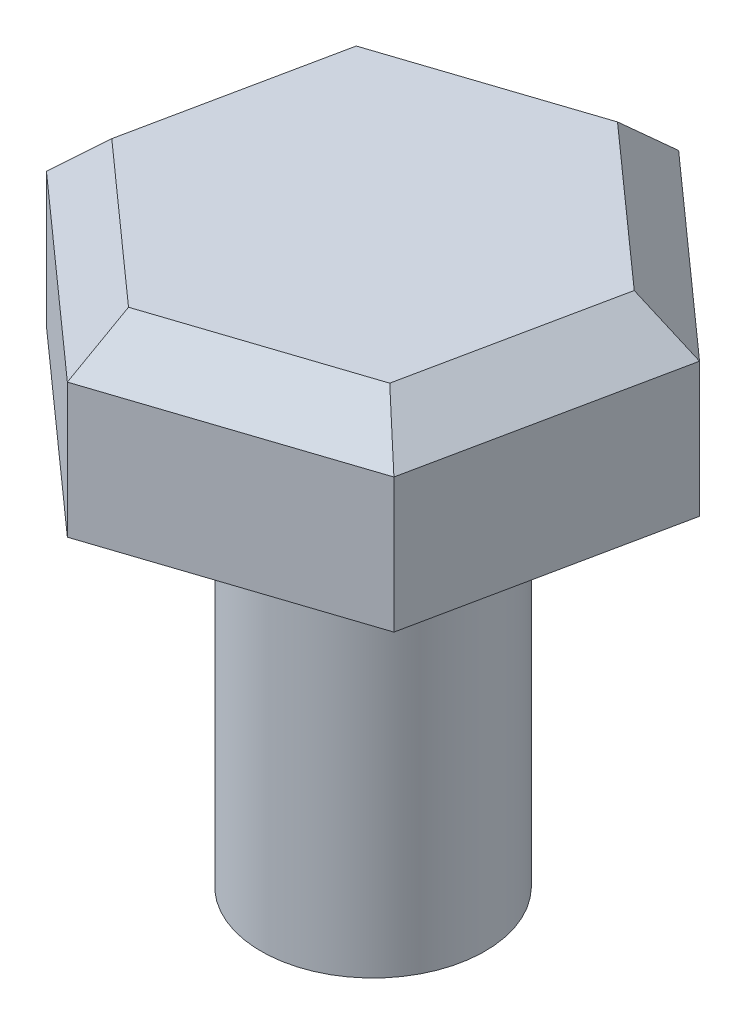
ISO-10303-21;
HEADER;
FILE_DESCRIPTION(('STEP AP214'),'2;1');
FILE_NAME('part.step','',(''),(''),'','','');
FILE_SCHEMA(('AUTOMOTIVE_DESIGN { 1 0 10303 214 1 1 1 1 }'));
ENDSEC;
DATA;
#1=APPLICATION_CONTEXT('core data for automotive mechanical design processes');
#2=APPLICATION_PROTOCOL_DEFINITION('international standard','automotive_design',2000,#1);
#3=PRODUCT_CONTEXT('',#1,'mechanical');
#4=PRODUCT('Part','Part','',(#3));
#5=PRODUCT_RELATED_PRODUCT_CATEGORY('part','',(#4));
#6=PRODUCT_DEFINITION_FORMATION('','',#4);
#7=PRODUCT_DEFINITION_CONTEXT('part definition',#1,'design');
#8=PRODUCT_DEFINITION('design','',#6,#7);
#9=PRODUCT_DEFINITION_SHAPE('','',#8);
#10=(LENGTH_UNIT() NAMED_UNIT(*) SI_UNIT(.MILLI.,.METRE.));
#11=(NAMED_UNIT(*) PLANE_ANGLE_UNIT() SI_UNIT($,.RADIAN.));
#12=(NAMED_UNIT(*) SI_UNIT($,.STERADIAN.) SOLID_ANGLE_UNIT());
#13=UNCERTAINTY_MEASURE_WITH_UNIT(LENGTH_MEASURE(1.E-05),#10,'distance_accuracy_value','');
#14=(GEOMETRIC_REPRESENTATION_CONTEXT(3) GLOBAL_UNCERTAINTY_ASSIGNED_CONTEXT((#13)) GLOBAL_UNIT_ASSIGNED_CONTEXT((#10,
#11,#12)) REPRESENTATION_CONTEXT('',''));
#15=CARTESIAN_POINT('',(0.,0.,0.));
#16=DIRECTION('',(0.,0.,1.));
#17=DIRECTION('',(1.,0.,0.));
#18=AXIS2_PLACEMENT_3D('',#15,#16,#17);
#19=CARTESIAN_POINT('',(4.3092791139155,4.,3.84232310610456));
#20=DIRECTION('',(-0.979146809030773,0.,-0.203153947450832));
#21=DIRECTION('',(-0.203153947450832,0.,0.979146809030773));
#22=AXIS2_PLACEMENT_3D('',#19,#20,#21);
#23=PLANE('',#22);
#24=DIRECTION('',(0.,-1.,0.));
#25=VECTOR('',#24,1.);
#26=CARTESIAN_POINT('',(5.48218897639223,4.,-1.81078363159624));
#27=LINE('',#26,#25);
#28=CARTESIAN_POINT('',(5.48218897639223,3.,-1.81078363159624));
#29=VERTEX_POINT('',#28);
#30=CARTESIAN_POINT('',(5.48218897639223,0.,-1.81078363159624));
#31=VERTEX_POINT('',#30);
#32=EDGE_CURVE('E119',#29,#31,#27,.T.);
#33=ORIENTED_EDGE('',*,*,#32,.F.);
#34=DIRECTION('',(-0.203153947450832,0.,0.979146809030773));
#35=VECTOR('',#34,1.);
#36=CARTESIAN_POINT('',(4.3092791139155,3.,3.84232310610456));
#37=LINE('',#36,#35);
#38=CARTESIAN_POINT('',(4.3092791139155,3.,3.84232310610456));
#39=VERTEX_POINT('',#38);
#40=EDGE_CURVE('E56',#29,#39,#37,.T.);
#41=ORIENTED_EDGE('',*,*,#40,.T.);
#42=DIRECTION('',(0.,-1.,0.));
#43=VECTOR('',#42,1.);
#44=CARTESIAN_POINT('',(4.3092791139155,4.,3.84232310610456));
#45=LINE('',#44,#43);
#46=CARTESIAN_POINT('',(4.3092791139155,0.,3.84232310610456));
#47=VERTEX_POINT('',#46);
#48=EDGE_CURVE('E142',#39,#47,#45,.T.);
#49=ORIENTED_EDGE('',*,*,#48,.T.);
#50=DIRECTION('',(0.203153947450832,0.,-0.979146809030773));
#51=VECTOR('',#50,1.);
#52=CARTESIAN_POINT('',(4.3092791139155,0.,3.84232310610456));
#53=LINE('',#52,#51);
#54=EDGE_CURVE('E135',#47,#31,#53,.T.);
#55=ORIENTED_EDGE('',*,*,#54,.T.);
#56=EDGE_LOOP('',(#33,#41,#49,#55));
#57=FACE_BOUND('',#56,.T.);
#58=ADVANCED_FACE('F45',(#57),#23,.F.);
#59=CARTESIAN_POINT('',(5.48218897639223,4.,-1.81078363159624));
#60=DIRECTION('',(-0.665509883886896,0.,0.746389036929703));
#61=DIRECTION('',(0.746389036929703,0.,0.665509883886896));
#62=AXIS2_PLACEMENT_3D('',#59,#60,#61);
#63=PLANE('',#62);
#64=DIRECTION('',(0.,-1.,0.));
#65=VECTOR('',#64,1.);
#66=CARTESIAN_POINT('',(1.17290986247673,4.,-5.6531067377008));
#67=LINE('',#66,#65);
#68=CARTESIAN_POINT('',(1.17290986247673,3.,-5.6531067377008));
#69=VERTEX_POINT('',#68);
#70=CARTESIAN_POINT('',(1.17290986247673,0.,-5.6531067377008));
#71=VERTEX_POINT('',#70);
#72=EDGE_CURVE('E129',#69,#71,#67,.T.);
#73=ORIENTED_EDGE('',*,*,#72,.F.);
#74=DIRECTION('',(0.746389036929703,0.,0.665509883886896));
#75=VECTOR('',#74,1.);
#76=CARTESIAN_POINT('',(5.48218897639223,3.,-1.81078363159624));
#77=LINE('',#76,#75);
#78=EDGE_CURVE('E64',#69,#29,#77,.T.);
#79=ORIENTED_EDGE('',*,*,#78,.T.);
#80=ORIENTED_EDGE('',*,*,#32,.T.);
#81=DIRECTION('',(-0.746389036929704,0.,-0.665509883886896));
#82=VECTOR('',#81,1.);
#83=CARTESIAN_POINT('',(5.48218897639223,0.,-1.81078363159624));
#84=LINE('',#83,#82);
#85=EDGE_CURVE('E122',#31,#71,#84,.T.);
#86=ORIENTED_EDGE('',*,*,#85,.T.);
#87=EDGE_LOOP('',(#73,#79,#80,#86));
#88=FACE_BOUND('',#87,.T.);
#89=ADVANCED_FACE('F121',(#88),#63,.F.);
#90=CARTESIAN_POINT('',(1.17290986247673,4.,-5.6531067377008));
#91=DIRECTION('',(0.313636925143877,0.,0.949542984380536));
#92=DIRECTION('',(0.949542984380536,0.,-0.313636925143877));
#93=AXIS2_PLACEMENT_3D('',#90,#91,#92);
#94=PLANE('',#93);
#95=DIRECTION('',(0.,-1.,0.));
#96=VECTOR('',#95,1.);
#97=CARTESIAN_POINT('',(-4.3092791139155,4.,-3.84232310610456));
#98=LINE('',#97,#96);
#99=CARTESIAN_POINT('',(-4.3092791139155,3.,-3.84232310610456));
#100=VERTEX_POINT('',#99);
#101=CARTESIAN_POINT('',(-4.3092791139155,0.,-3.84232310610456));
#102=VERTEX_POINT('',#101);
#103=EDGE_CURVE('E172',#100,#102,#98,.T.);
#104=ORIENTED_EDGE('',*,*,#103,.F.);
#105=DIRECTION('',(0.949542984380536,0.,-0.313636925143877));
#106=VECTOR('',#105,1.);
#107=CARTESIAN_POINT('',(1.17290986247673,3.,-5.6531067377008));
#108=LINE('',#107,#106);
#109=EDGE_CURVE('E72',#100,#69,#108,.T.);
#110=ORIENTED_EDGE('',*,*,#109,.T.);
#111=ORIENTED_EDGE('',*,*,#72,.T.);
#112=DIRECTION('',(-0.949542984380536,0.,0.313636925143877));
#113=VECTOR('',#112,1.);
#114=CARTESIAN_POINT('',(1.17290986247673,0.,-5.6531067377008));
#115=LINE('',#114,#113);
#116=EDGE_CURVE('E138',#71,#102,#115,.T.);
#117=ORIENTED_EDGE('',*,*,#116,.T.);
#118=EDGE_LOOP('',(#104,#110,#111,#117));
#119=FACE_BOUND('',#118,.T.);
#120=ADVANCED_FACE('F276',(#119),#94,.F.);
#121=CARTESIAN_POINT('',(-4.3092791139155,4.,-3.84232310610456));
#122=DIRECTION('',(0.979146809030773,0.,0.203153947450832));
#123=DIRECTION('',(0.203153947450832,0.,-0.979146809030773));
#124=AXIS2_PLACEMENT_3D('',#121,#122,#123);
#125=PLANE('',#124);
#126=DIRECTION('',(0.,-1.,0.));
#127=VECTOR('',#126,1.);
#128=CARTESIAN_POINT('',(-5.48218897639223,4.,1.81078363159624));
#129=LINE('',#128,#127);
#130=CARTESIAN_POINT('',(-5.48218897639223,3.,1.81078363159624));
#131=VERTEX_POINT('',#130);
#132=CARTESIAN_POINT('',(-5.48218897639223,0.,1.81078363159624));
#133=VERTEX_POINT('',#132);
#134=EDGE_CURVE('E169',#131,#133,#129,.T.);
#135=ORIENTED_EDGE('',*,*,#134,.F.);
#136=DIRECTION('',(0.203153947450832,0.,-0.979146809030773));
#137=VECTOR('',#136,1.);
#138=CARTESIAN_POINT('',(-4.3092791139155,3.,-3.84232310610456));
#139=LINE('',#138,#137);
#140=EDGE_CURVE('E202',#131,#100,#139,.T.);
#141=ORIENTED_EDGE('',*,*,#140,.T.);
#142=ORIENTED_EDGE('',*,*,#103,.T.);
#143=DIRECTION('',(-0.203153947450832,0.,0.979146809030773));
#144=VECTOR('',#143,1.);
#145=CARTESIAN_POINT('',(-4.3092791139155,0.,-3.84232310610456));
#146=LINE('',#145,#144);
#147=EDGE_CURVE('E153',#102,#133,#146,.T.);
#148=ORIENTED_EDGE('',*,*,#147,.T.);
#149=EDGE_LOOP('',(#135,#141,#142,#148));
#150=FACE_BOUND('',#149,.T.);
#151=ADVANCED_FACE('F260',(#150),#125,.F.);
#152=CARTESIAN_POINT('',(-5.48218897639223,4.,1.81078363159624));
#153=DIRECTION('',(0.665509883886897,0.,-0.746389036929703));
#154=DIRECTION('',(-0.746389036929703,0.,-0.665509883886897));
#155=AXIS2_PLACEMENT_3D('',#152,#153,#154);
#156=PLANE('',#155);
#157=DIRECTION('',(0.,-1.,0.));
#158=VECTOR('',#157,1.);
#159=CARTESIAN_POINT('',(-1.17290986247673,4.,5.6531067377008));
#160=LINE('',#159,#158);
#161=CARTESIAN_POINT('',(-1.17290986247673,3.,5.6531067377008));
#162=VERTEX_POINT('',#161);
#163=CARTESIAN_POINT('',(-1.17290986247673,0.,5.6531067377008));
#164=VERTEX_POINT('',#163);
#165=EDGE_CURVE('E166',#162,#164,#160,.T.);
#166=ORIENTED_EDGE('',*,*,#165,.F.);
#167=DIRECTION('',(-0.746389036929703,0.,-0.665509883886897));
#168=VECTOR('',#167,1.);
#169=CARTESIAN_POINT('',(-5.48218897639223,3.,1.81078363159624));
#170=LINE('',#169,#168);
#171=EDGE_CURVE('E199',#162,#131,#170,.T.);
#172=ORIENTED_EDGE('',*,*,#171,.T.);
#173=ORIENTED_EDGE('',*,*,#134,.T.);
#174=DIRECTION('',(0.746389036929703,0.,0.665509883886897));
#175=VECTOR('',#174,1.);
#176=CARTESIAN_POINT('',(-5.48218897639223,0.,1.81078363159624));
#177=LINE('',#176,#175);
#178=EDGE_CURVE('E157',#133,#164,#177,.T.);
#179=ORIENTED_EDGE('',*,*,#178,.T.);
#180=EDGE_LOOP('',(#166,#172,#173,#179));
#181=FACE_BOUND('',#180,.T.);
#182=ADVANCED_FACE('F257',(#181),#156,.F.);
#183=CARTESIAN_POINT('',(-1.17290986247673,4.,5.6531067377008));
#184=DIRECTION('',(-0.313636925143877,0.,-0.949542984380536));
#185=DIRECTION('',(-0.949542984380536,0.,0.313636925143877));
#186=AXIS2_PLACEMENT_3D('',#183,#184,#185);
#187=PLANE('',#186);
#188=ORIENTED_EDGE('',*,*,#48,.F.);
#189=DIRECTION('',(-0.949542984380536,0.,0.313636925143877));
#190=VECTOR('',#189,1.);
#191=CARTESIAN_POINT('',(-1.17290986247673,3.,5.6531067377008));
#192=LINE('',#191,#190);
#193=EDGE_CURVE('E195',#39,#162,#192,.T.);
#194=ORIENTED_EDGE('',*,*,#193,.T.);
#195=ORIENTED_EDGE('',*,*,#165,.T.);
#196=DIRECTION('',(0.949542984380536,0.,-0.313636925143877));
#197=VECTOR('',#196,1.);
#198=CARTESIAN_POINT('',(-1.17290986247673,0.,5.6531067377008));
#199=LINE('',#198,#197);
#200=EDGE_CURVE('E161',#164,#47,#199,.T.);
#201=ORIENTED_EDGE('',*,*,#200,.T.);
#202=EDGE_LOOP('',(#188,#194,#195,#201));
#203=FACE_BOUND('',#202,.T.);
#204=ADVANCED_FACE('F246',(#203),#187,.F.);
#205=CARTESIAN_POINT('',(0.,4.,0.));
#206=DIRECTION('',(0.,1.,0.));
#207=DIRECTION('',(0.,0.,1.));
#208=AXIS2_PLACEMENT_3D('',#205,#206,#207);
#209=PLANE('',#208);
#210=DIRECTION('',(0.746389036929703,0.,0.665509883886897));
#211=VECTOR('',#210,1.);
#212=CARTESIAN_POINT('',(-0.507399978589836,4.,4.9067177007711));
#213=LINE('',#212,#211);
#214=CARTESIAN_POINT('',(-4.38575118111378,4.,1.44862690527699));
#215=VERTEX_POINT('',#214);
#216=CARTESIAN_POINT('',(-0.938327889981387,4.,4.52248539016064));
#217=VERTEX_POINT('',#216);
#218=EDGE_CURVE('E188',#215,#217,#213,.T.);
#219=ORIENTED_EDGE('',*,*,#218,.T.);
#220=DIRECTION('',(0.949542984380536,0.,-0.313636925143877));
#221=VECTOR('',#220,1.);
#222=CARTESIAN_POINT('',(3.99564218877162,4.,2.89278012172403));
#223=LINE('',#222,#221);
#224=CARTESIAN_POINT('',(3.4474232911324,4.,3.07385848488365));
#225=VERTEX_POINT('',#224);
#226=EDGE_CURVE('E191',#217,#225,#223,.T.);
#227=ORIENTED_EDGE('',*,*,#226,.T.);
#228=DIRECTION('',(0.203153947450832,0.,-0.979146809030773));
#229=VECTOR('',#228,1.);
#230=CARTESIAN_POINT('',(4.50304216736146,4.,-2.01393757904707));
#231=LINE('',#230,#229);
#232=CARTESIAN_POINT('',(4.38575118111378,4.,-1.44862690527699));
#233=VERTEX_POINT('',#232);
#234=EDGE_CURVE('E128',#225,#233,#231,.T.);
#235=ORIENTED_EDGE('',*,*,#234,.T.);
#236=DIRECTION('',(-0.746389036929703,0.,-0.665509883886896));
#237=VECTOR('',#236,1.);
#238=CARTESIAN_POINT('',(0.507399978589836,4.,-4.90671770077109));
#239=LINE('',#238,#237);
#240=CARTESIAN_POINT('',(0.938327889981385,4.,-4.52248539016064));
#241=VERTEX_POINT('',#240);
#242=EDGE_CURVE('E179',#233,#241,#239,.T.);
#243=ORIENTED_EDGE('',*,*,#242,.T.);
#244=DIRECTION('',(-0.949542984380536,0.,0.313636925143877));
#245=VECTOR('',#244,1.);
#246=CARTESIAN_POINT('',(-3.99564218877162,4.,-2.89278012172402));
#247=LINE('',#246,#245);
#248=CARTESIAN_POINT('',(-3.4474232911324,4.,-3.07385848488365));
#249=VERTEX_POINT('',#248);
#250=EDGE_CURVE('E182',#241,#249,#247,.T.);
#251=ORIENTED_EDGE('',*,*,#250,.T.);
#252=DIRECTION('',(-0.203153947450832,0.,0.979146809030773));
#253=VECTOR('',#252,1.);
#254=CARTESIAN_POINT('',(-4.50304216736146,4.,2.01393757904707));
#255=LINE('',#254,#253);
#256=EDGE_CURVE('E185',#249,#215,#255,.T.);
#257=ORIENTED_EDGE('',*,*,#256,.T.);
#258=EDGE_LOOP('',(#219,#227,#235,#243,#251,#257));
#259=FACE_BOUND('',#258,.T.);
#260=ADVANCED_FACE('F236',(#259),#209,.T.);
#261=CARTESIAN_POINT('',(0.,0.,0.));
#262=DIRECTION('',(0.,1.,0.));
#263=DIRECTION('',(0.,0.,1.));
#264=AXIS2_PLACEMENT_3D('',#261,#262,#263);
#265=PLANE('',#264);
#266=CARTESIAN_POINT('',(0.,0.,0.));
#267=DIRECTION('',(0.,-1.,0.));
#268=DIRECTION('',(0.,0.,-1.));
#269=AXIS2_PLACEMENT_3D('',#266,#267,#268);
#270=CIRCLE('',#269,2.5);
#271=CARTESIAN_POINT('',(0.,0.,-2.5));
#272=VERTEX_POINT('',#271);
#273=EDGE_CURVE('E11',#272,#272,#270,.T.);
#274=ORIENTED_EDGE('',*,*,#273,.F.);
#275=EDGE_LOOP('',(#274));
#276=FACE_BOUND('',#275,.T.);
#277=ORIENTED_EDGE('',*,*,#54,.F.);
#278=ORIENTED_EDGE('',*,*,#200,.F.);
#279=ORIENTED_EDGE('',*,*,#178,.F.);
#280=ORIENTED_EDGE('',*,*,#147,.F.);
#281=ORIENTED_EDGE('',*,*,#116,.F.);
#282=ORIENTED_EDGE('',*,*,#85,.F.);
#283=EDGE_LOOP('',(#277,#278,#279,#280,#281,#282));
#284=FACE_BOUND('',#283,.T.);
#285=ADVANCED_FACE('F133',(#276,#284),#265,.F.);
#286=CARTESIAN_POINT('',(-1.25454770057551,4.,-3.79817193752214));
#287=DIRECTION('',(-0.221774796599733,0.707106781186547,-0.67142828328359));
#288=DIRECTION('',(0.949542984380536,0.,-0.313636925143877));
#289=AXIS2_PLACEMENT_3D('',#286,#287,#288);
#290=PLANE('',#289);
#291=DIRECTION('',(-0.153569949375996,0.654653670707978,0.740165415347964));
#292=VECTOR('',#291,1.);
#293=CARTESIAN_POINT('',(0.804281048555474,4.57142857142857,-3.87641604870912));
#294=LINE('',#293,#292);
#295=EDGE_CURVE('E148',#69,#241,#294,.T.);
#296=ORIENTED_EDGE('',*,*,#295,.F.);
#297=ORIENTED_EDGE('',*,*,#109,.F.);
#298=DIRECTION('',(0.564217078005999,0.654653670707978,0.503078185091485));
#299=VECTOR('',#298,1.);
#300=CARTESIAN_POINT('',(-2.95493424954206,4.57142857142857,-2.63473584418599));
#301=LINE('',#300,#299);
#302=EDGE_CURVE('E50',#249,#100,#301,.F.);
#303=ORIENTED_EDGE('',*,*,#302,.F.);
#304=ORIENTED_EDGE('',*,*,#250,.F.);
#305=EDGE_LOOP('',(#296,#297,#303,#304));
#306=FACE_BOUND('',#305,.T.);
#307=ADVANCED_FACE('F48',(#306),#290,.T.);
#308=CARTESIAN_POINT('',(-3.91658723612309,4.,-0.812615789803329));
#309=DIRECTION('',(-0.692361348442829,0.707106781186547,-0.143651533867299));
#310=DIRECTION('',(0.203153947450832,0.,-0.979146809030773));
#311=AXIS2_PLACEMENT_3D('',#308,#309,#310);
#312=PLANE('',#311);
#313=ORIENTED_EDGE('',*,*,#302,.T.);
#314=ORIENTED_EDGE('',*,*,#140,.F.);
#315=DIRECTION('',(0.717787027381996,0.654653670707978,-0.237087230256479));
#316=VECTOR('',#315,1.);
#317=CARTESIAN_POINT('',(-3.75921529809753,4.57142857142857,1.24168020452314));
#318=LINE('',#317,#316);
#319=EDGE_CURVE('E222',#215,#131,#318,.F.);
#320=ORIENTED_EDGE('',*,*,#319,.F.);
#321=ORIENTED_EDGE('',*,*,#256,.F.);
#322=EDGE_LOOP('',(#313,#314,#320,#321));
#323=FACE_BOUND('',#322,.T.);
#324=ADVANCED_FACE('F263',(#323),#312,.T.);
#325=CARTESIAN_POINT('',(2.66203953554758,4.,-2.98555614771881));
#326=DIRECTION('',(0.470586551843097,0.707106781186547,-0.52777674941629));
#327=DIRECTION('',(0.746389036929703,0.,0.665509883886896));
#328=AXIS2_PLACEMENT_3D('',#325,#326,#327);
#329=PLANE('',#328);
#330=ORIENTED_EDGE('',*,*,#295,.T.);
#331=ORIENTED_EDGE('',*,*,#242,.F.);
#332=DIRECTION('',(-0.717787027381996,0.654653670707978,0.237087230256479));
#333=VECTOR('',#332,1.);
#334=CARTESIAN_POINT('',(3.75921529809753,4.57142857142857,-1.24168020452314));
#335=LINE('',#334,#333);
#336=EDGE_CURVE('E218',#29,#233,#335,.T.);
#337=ORIENTED_EDGE('',*,*,#336,.F.);
#338=ORIENTED_EDGE('',*,*,#78,.F.);
#339=EDGE_LOOP('',(#330,#331,#337,#338));
#340=FACE_BOUND('',#339,.T.);
#341=ADVANCED_FACE('F230',(#340),#329,.T.);
#342=CARTESIAN_POINT('',(-2.66203953554759,4.,2.98555614771881));
#343=DIRECTION('',(-0.470586551843097,0.707106781186547,0.52777674941629));
#344=DIRECTION('',(-0.746389036929703,0.,-0.665509883886897));
#345=AXIS2_PLACEMENT_3D('',#342,#343,#344);
#346=PLANE('',#345);
#347=ORIENTED_EDGE('',*,*,#319,.T.);
#348=ORIENTED_EDGE('',*,*,#171,.F.);
#349=DIRECTION('',(0.153569949375995,0.654653670707978,-0.740165415347965));
#350=VECTOR('',#349,1.);
#351=CARTESIAN_POINT('',(-0.804281048555476,4.57142857142857,3.87641604870912));
#352=LINE('',#351,#350);
#353=EDGE_CURVE('E214',#217,#162,#352,.F.);
#354=ORIENTED_EDGE('',*,*,#353,.F.);
#355=ORIENTED_EDGE('',*,*,#218,.F.);
#356=EDGE_LOOP('',(#347,#348,#354,#355));
#357=FACE_BOUND('',#356,.T.);
#358=ADVANCED_FACE('F254',(#357),#346,.T.);
#359=CARTESIAN_POINT('',(3.91658723612309,4.,0.812615789803327));
#360=DIRECTION('',(0.692361348442829,0.707106781186547,0.143651533867299));
#361=DIRECTION('',(-0.203153947450832,0.,0.979146809030773));
#362=AXIS2_PLACEMENT_3D('',#359,#360,#361);
#363=PLANE('',#362);
#364=ORIENTED_EDGE('',*,*,#336,.T.);
#365=ORIENTED_EDGE('',*,*,#234,.F.);
#366=DIRECTION('',(0.564217078006,-0.654653670707977,0.503078185091485));
#367=VECTOR('',#366,1.);
#368=CARTESIAN_POINT('',(2.95493424954206,4.57142857142857,2.63473584418598));
#369=LINE('',#368,#367);
#370=EDGE_CURVE('E211',#39,#225,#369,.F.);
#371=ORIENTED_EDGE('',*,*,#370,.F.);
#372=ORIENTED_EDGE('',*,*,#40,.F.);
#373=EDGE_LOOP('',(#364,#365,#371,#372));
#374=FACE_BOUND('',#373,.T.);
#375=ADVANCED_FACE('F242',(#374),#363,.T.);
#376=CARTESIAN_POINT('',(1.25454770057551,4.,3.79817193752214));
#377=DIRECTION('',(0.221774796599733,0.707106781186547,0.671428283283589));
#378=DIRECTION('',(-0.949542984380536,0.,0.313636925143877));
#379=AXIS2_PLACEMENT_3D('',#376,#377,#378);
#380=PLANE('',#379);
#381=ORIENTED_EDGE('',*,*,#353,.T.);
#382=ORIENTED_EDGE('',*,*,#193,.F.);
#383=ORIENTED_EDGE('',*,*,#370,.T.);
#384=ORIENTED_EDGE('',*,*,#226,.F.);
#385=EDGE_LOOP('',(#381,#382,#383,#384));
#386=FACE_BOUND('',#385,.T.);
#387=ADVANCED_FACE('F249',(#386),#380,.T.);
#388=CARTESIAN_POINT('',(0.,-9.,0.));
#389=DIRECTION('',(0.,1.,0.));
#390=DIRECTION('',(0.,0.,1.));
#391=AXIS2_PLACEMENT_3D('',#388,#389,#390);
#392=CYLINDRICAL_SURFACE('',#391,2.5);
#393=CARTESIAN_POINT('',(0.,-9.,0.));
#394=DIRECTION('',(0.,-1.,0.));
#395=DIRECTION('',(0.,0.,-1.));
#396=AXIS2_PLACEMENT_3D('',#393,#394,#395);
#397=CIRCLE('',#396,2.5);
#398=CARTESIAN_POINT('',(0.,-9.,-2.5));
#399=VERTEX_POINT('',#398);
#400=EDGE_CURVE('E215',#399,#399,#397,.T.);
#401=ORIENTED_EDGE('',*,*,#400,.F.);
#402=EDGE_LOOP('',(#401));
#403=FACE_BOUND('',#402,.T.);
#404=ORIENTED_EDGE('',*,*,#273,.T.);
#405=EDGE_LOOP('',(#404));
#406=FACE_BOUND('',#405,.T.);
#407=ADVANCED_FACE('F286',(#403,#406),#392,.T.);
#408=CARTESIAN_POINT('',(0.,-9.,0.));
#409=DIRECTION('',(0.,-1.,0.));
#410=DIRECTION('',(0.,0.,-1.));
#411=AXIS2_PLACEMENT_3D('',#408,#409,#410);
#412=PLANE('',#411);
#413=ORIENTED_EDGE('',*,*,#400,.T.);
#414=EDGE_LOOP('',(#413));
#415=FACE_BOUND('',#414,.T.);
#416=ADVANCED_FACE('F321',(#415),#412,.T.);
#417=CLOSED_SHELL('',(#58,#89,#120,#151,#182,#204,#260,#285,#307,#324,#341,#358,#375,#387,#407,#416));
#418=MANIFOLD_SOLID_BREP('B2',#417);
#419=ADVANCED_BREP_SHAPE_REPRESENTATION('',(#18,#418),#14);
#420=SHAPE_DEFINITION_REPRESENTATION(#9,#419);
ENDSEC;
END-ISO-10303-21;
